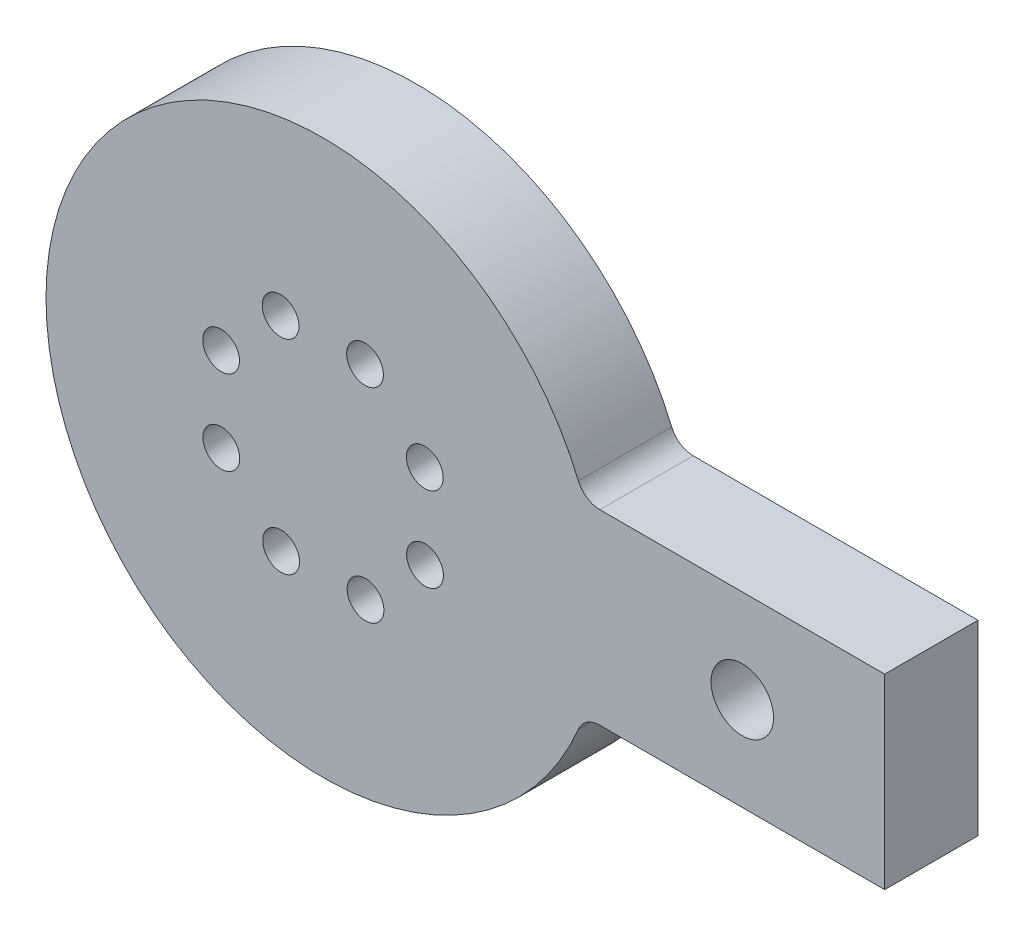
ISO-10303-21;
HEADER;
FILE_DESCRIPTION(('STEP AP214'),'2;1');
FILE_NAME('part.step','',(''),(''),'','','');
FILE_SCHEMA(('AUTOMOTIVE_DESIGN { 1 0 10303 214 1 1 1 1 }'));
ENDSEC;
DATA;
#1=APPLICATION_CONTEXT('core data for automotive mechanical design processes');
#2=APPLICATION_PROTOCOL_DEFINITION('international standard','automotive_design',2000,#1);
#3=PRODUCT_CONTEXT('',#1,'mechanical');
#4=PRODUCT('Part','Part','',(#3));
#5=PRODUCT_RELATED_PRODUCT_CATEGORY('part','',(#4));
#6=PRODUCT_DEFINITION_FORMATION('','',#4);
#7=PRODUCT_DEFINITION_CONTEXT('part definition',#1,'design');
#8=PRODUCT_DEFINITION('design','',#6,#7);
#9=PRODUCT_DEFINITION_SHAPE('','',#8);
#10=(LENGTH_UNIT() NAMED_UNIT(*) SI_UNIT(.MILLI.,.METRE.));
#11=(NAMED_UNIT(*) PLANE_ANGLE_UNIT() SI_UNIT($,.RADIAN.));
#12=(NAMED_UNIT(*) SI_UNIT($,.STERADIAN.) SOLID_ANGLE_UNIT());
#13=UNCERTAINTY_MEASURE_WITH_UNIT(LENGTH_MEASURE(1.E-05),#10,'distance_accuracy_value','');
#14=(GEOMETRIC_REPRESENTATION_CONTEXT(3) GLOBAL_UNCERTAINTY_ASSIGNED_CONTEXT((#13)) GLOBAL_UNIT_ASSIGNED_CONTEXT((#10,
#11,#12)) REPRESENTATION_CONTEXT('',''));
#15=CARTESIAN_POINT('',(0.,0.,0.));
#16=DIRECTION('',(0.,0.,1.));
#17=DIRECTION('',(1.,0.,0.));
#18=AXIS2_PLACEMENT_3D('',#15,#16,#17);
#19=CARTESIAN_POINT('',(0.,0.,12.7));
#20=DIRECTION('',(0.,0.,-1.));
#21=DIRECTION('',(-1.,0.,0.));
#22=AXIS2_PLACEMENT_3D('',#19,#20,#21);
#23=CYLINDRICAL_SURFACE('',#22,37.7);
#24=CARTESIAN_POINT('',(0.,0.,0.));
#25=DIRECTION('',(0.,0.,1.));
#26=DIRECTION('',(1.,0.,0.));
#27=AXIS2_PLACEMENT_3D('',#24,#25,#26);
#28=CIRCLE('',#27,37.7);
#29=CARTESIAN_POINT('',(34.7405365647792,14.6418960244648,0.));
#30=VERTEX_POINT('',#29);
#31=CARTESIAN_POINT('',(34.7405365647792,-14.6418960244648,0.));
#32=VERTEX_POINT('',#31);
#33=EDGE_CURVE('E144',#30,#32,#28,.T.);
#34=ORIENTED_EDGE('',*,*,#33,.T.);
#35=DIRECTION('',(0.,0.,-1.));
#36=VECTOR('',#35,1.);
#37=CARTESIAN_POINT('',(34.7405365647792,-14.6418960244648,12.7));
#38=LINE('',#37,#36);
#39=CARTESIAN_POINT('',(34.7405365647792,-14.6418960244648,12.7));
#40=VERTEX_POINT('',#39);
#41=EDGE_CURVE('E176',#32,#40,#38,.F.);
#42=ORIENTED_EDGE('',*,*,#41,.T.);
#43=CARTESIAN_POINT('',(0.,0.,12.7));
#44=DIRECTION('',(0.,0.,1.));
#45=DIRECTION('',(1.,0.,0.));
#46=AXIS2_PLACEMENT_3D('',#43,#44,#45);
#47=CIRCLE('',#46,37.7);
#48=CARTESIAN_POINT('',(34.7405365647792,14.6418960244648,12.7));
#49=VERTEX_POINT('',#48);
#50=EDGE_CURVE('E99',#49,#40,#47,.T.);
#51=ORIENTED_EDGE('',*,*,#50,.F.);
#52=DIRECTION('',(0.,0.,-1.));
#53=VECTOR('',#52,1.);
#54=CARTESIAN_POINT('',(34.7405365647792,14.6418960244648,12.7));
#55=LINE('',#54,#53);
#56=EDGE_CURVE('E173',#49,#30,#55,.T.);
#57=ORIENTED_EDGE('',*,*,#56,.T.);
#58=EDGE_LOOP('',(#34,#42,#51,#57));
#59=FACE_BOUND('',#58,.T.);
#60=ADVANCED_FACE('F35',(#59),#23,.T.);
#61=CARTESIAN_POINT('',(0.,-12.7,12.7));
#62=DIRECTION('',(0.,1.,0.));
#63=DIRECTION('',(0.,0.,1.));
#64=AXIS2_PLACEMENT_3D('',#61,#62,#63);
#65=PLANE('',#64);
#66=DIRECTION('',(1.,0.,0.));
#67=VECTOR('',#66,1.);
#68=CARTESIAN_POINT('',(0.,-12.7,12.7));
#69=LINE('',#68,#67);
#70=CARTESIAN_POINT('',(37.6662979332984,-12.7,12.7));
#71=VERTEX_POINT('',#70);
#72=CARTESIAN_POINT('',(76.4173000154748,-12.7,12.7));
#73=VERTEX_POINT('',#72);
#74=EDGE_CURVE('E86',#71,#73,#69,.T.);
#75=ORIENTED_EDGE('',*,*,#74,.F.);
#76=DIRECTION('',(0.,0.,1.));
#77=VECTOR('',#76,1.);
#78=CARTESIAN_POINT('',(37.6662979332984,-12.7,0.));
#79=LINE('',#78,#77);
#80=CARTESIAN_POINT('',(37.6662979332984,-12.7,0.));
#81=VERTEX_POINT('',#80);
#82=EDGE_CURVE('E109',#71,#81,#79,.F.);
#83=ORIENTED_EDGE('',*,*,#82,.T.);
#84=DIRECTION('',(1.,0.,0.));
#85=VECTOR('',#84,1.);
#86=CARTESIAN_POINT('',(0.,-12.7,0.));
#87=LINE('',#86,#85);
#88=CARTESIAN_POINT('',(76.4173000154748,-12.7,0.));
#89=VERTEX_POINT('',#88);
#90=EDGE_CURVE('E105',#81,#89,#87,.T.);
#91=ORIENTED_EDGE('',*,*,#90,.T.);
#92=DIRECTION('',(0.,0.,-1.));
#93=VECTOR('',#92,1.);
#94=CARTESIAN_POINT('',(76.4173000154748,-12.7,12.7));
#95=LINE('',#94,#93);
#96=EDGE_CURVE('E102',#73,#89,#95,.T.);
#97=ORIENTED_EDGE('',*,*,#96,.F.);
#98=EDGE_LOOP('',(#75,#83,#91,#97));
#99=FACE_BOUND('',#98,.T.);
#100=ADVANCED_FACE('F103',(#99),#65,.F.);
#101=CARTESIAN_POINT('',(76.4173000154748,0.,12.7));
#102=DIRECTION('',(-1.,0.,0.));
#103=DIRECTION('',(0.,0.,1.));
#104=AXIS2_PLACEMENT_3D('',#101,#102,#103);
#105=PLANE('',#104);
#106=DIRECTION('',(0.,1.,0.));
#107=VECTOR('',#106,1.);
#108=CARTESIAN_POINT('',(76.4173000154748,0.,0.));
#109=LINE('',#108,#107);
#110=CARTESIAN_POINT('',(76.4173000154748,12.7,0.));
#111=VERTEX_POINT('',#110);
#112=EDGE_CURVE('E148',#89,#111,#109,.T.);
#113=ORIENTED_EDGE('',*,*,#112,.T.);
#114=DIRECTION('',(0.,0.,-1.));
#115=VECTOR('',#114,1.);
#116=CARTESIAN_POINT('',(76.4173000154748,12.7,12.7));
#117=LINE('',#116,#115);
#118=CARTESIAN_POINT('',(76.4173000154748,12.7,12.7));
#119=VERTEX_POINT('',#118);
#120=EDGE_CURVE('E110',#119,#111,#117,.T.);
#121=ORIENTED_EDGE('',*,*,#120,.F.);
#122=DIRECTION('',(0.,1.,0.));
#123=VECTOR('',#122,1.);
#124=CARTESIAN_POINT('',(76.4173000154748,0.,12.7));
#125=LINE('',#124,#123);
#126=EDGE_CURVE('E91',#73,#119,#125,.T.);
#127=ORIENTED_EDGE('',*,*,#126,.F.);
#128=ORIENTED_EDGE('',*,*,#96,.T.);
#129=EDGE_LOOP('',(#113,#121,#127,#128));
#130=FACE_BOUND('',#129,.T.);
#131=ADVANCED_FACE('F112',(#130),#105,.F.);
#132=CARTESIAN_POINT('',(13.8436983699948,5.77512038321301,12.7));
#133=DIRECTION('',(0.,0.,-1.));
#134=DIRECTION('',(-1.,0.,0.));
#135=AXIS2_PLACEMENT_3D('',#132,#133,#134);
#136=CYLINDRICAL_SURFACE('',#135,2.49999999999999);
#137=CARTESIAN_POINT('',(13.8436983699948,5.77512038321301,12.7));
#138=DIRECTION('',(0.,0.,1.));
#139=DIRECTION('',(1.,0.,0.));
#140=AXIS2_PLACEMENT_3D('',#137,#138,#139);
#141=CIRCLE('',#140,2.49999999999999);
#142=CARTESIAN_POINT('',(16.3436983699948,5.77512038321301,12.7));
#143=VERTEX_POINT('',#142);
#144=EDGE_CURVE('E131',#143,#143,#141,.T.);
#145=ORIENTED_EDGE('',*,*,#144,.T.);
#146=EDGE_LOOP('',(#145));
#147=FACE_BOUND('',#146,.T.);
#148=CARTESIAN_POINT('',(13.8436983699948,5.77512038321301,0.));
#149=DIRECTION('',(0.,0.,1.));
#150=DIRECTION('',(1.,0.,0.));
#151=AXIS2_PLACEMENT_3D('',#148,#149,#150);
#152=CIRCLE('',#151,2.49999999999999);
#153=CARTESIAN_POINT('',(16.3436983699948,5.77512038321301,0.));
#154=VERTEX_POINT('',#153);
#155=EDGE_CURVE('E164',#154,#154,#152,.T.);
#156=ORIENTED_EDGE('',*,*,#155,.F.);
#157=EDGE_LOOP('',(#156));
#158=FACE_BOUND('',#157,.T.);
#159=ADVANCED_FACE('F247',(#147,#158),#136,.F.);
#160=CARTESIAN_POINT('',(-13.8725997792633,5.70534620898534,12.7));
#161=DIRECTION('',(0.,0.,-1.));
#162=DIRECTION('',(-1.,0.,0.));
#163=AXIS2_PLACEMENT_3D('',#160,#161,#162);
#164=CYLINDRICAL_SURFACE('',#163,2.5);
#165=CARTESIAN_POINT('',(-13.8725997792633,5.70534620898534,12.7));
#166=DIRECTION('',(0.,0.,1.));
#167=DIRECTION('',(1.,0.,0.));
#168=AXIS2_PLACEMENT_3D('',#165,#166,#167);
#169=CIRCLE('',#168,2.5);
#170=CARTESIAN_POINT('',(-11.3725997792633,5.70534620898534,12.7));
#171=VERTEX_POINT('',#170);
#172=EDGE_CURVE('E128',#171,#171,#169,.T.);
#173=ORIENTED_EDGE('',*,*,#172,.T.);
#174=EDGE_LOOP('',(#173));
#175=FACE_BOUND('',#174,.T.);
#176=CARTESIAN_POINT('',(-13.8725997792633,5.70534620898534,0.));
#177=DIRECTION('',(0.,0.,1.));
#178=DIRECTION('',(1.,0.,0.));
#179=AXIS2_PLACEMENT_3D('',#176,#177,#178);
#180=CIRCLE('',#179,2.5);
#181=CARTESIAN_POINT('',(-11.3725997792633,5.70534620898534,0.));
#182=VERTEX_POINT('',#181);
#183=EDGE_CURVE('E161',#182,#182,#180,.T.);
#184=ORIENTED_EDGE('',*,*,#183,.F.);
#185=EDGE_LOOP('',(#184));
#186=FACE_BOUND('',#185,.T.);
#187=ADVANCED_FACE('F251',(#175,#186),#164,.F.);
#188=CARTESIAN_POINT('',(-13.8436983699948,-5.7751203832136,12.7));
#189=DIRECTION('',(0.,0.,-1.));
#190=DIRECTION('',(-1.,0.,0.));
#191=AXIS2_PLACEMENT_3D('',#188,#189,#190);
#192=CYLINDRICAL_SURFACE('',#191,2.5);
#193=CARTESIAN_POINT('',(-13.8436983699948,-5.7751203832136,12.7));
#194=DIRECTION('',(0.,0.,1.));
#195=DIRECTION('',(1.,0.,0.));
#196=AXIS2_PLACEMENT_3D('',#193,#194,#195);
#197=CIRCLE('',#196,2.5);
#198=CARTESIAN_POINT('',(-11.3436983699948,-5.7751203832136,12.7));
#199=VERTEX_POINT('',#198);
#200=EDGE_CURVE('E125',#199,#199,#197,.T.);
#201=ORIENTED_EDGE('',*,*,#200,.T.);
#202=EDGE_LOOP('',(#201));
#203=FACE_BOUND('',#202,.T.);
#204=CARTESIAN_POINT('',(-13.8436983699948,-5.7751203832136,0.));
#205=DIRECTION('',(0.,0.,1.));
#206=DIRECTION('',(1.,0.,0.));
#207=AXIS2_PLACEMENT_3D('',#204,#205,#206);
#208=CIRCLE('',#207,2.5);
#209=CARTESIAN_POINT('',(-11.3436983699948,-5.7751203832136,0.));
#210=VERTEX_POINT('',#209);
#211=EDGE_CURVE('E158',#210,#210,#208,.T.);
#212=ORIENTED_EDGE('',*,*,#211,.F.);
#213=EDGE_LOOP('',(#212));
#214=FACE_BOUND('',#213,.T.);
#215=ADVANCED_FACE('F257',(#203,#214),#192,.F.);
#216=CARTESIAN_POINT('',(-5.70534620898581,-13.8725997792631,12.7));
#217=DIRECTION('',(0.,0.,-1.));
#218=DIRECTION('',(-1.,0.,0.));
#219=AXIS2_PLACEMENT_3D('',#216,#217,#218);
#220=CYLINDRICAL_SURFACE('',#219,2.5);
#221=CARTESIAN_POINT('',(-5.70534620898581,-13.8725997792631,12.7));
#222=DIRECTION('',(0.,0.,1.));
#223=DIRECTION('',(1.,0.,0.));
#224=AXIS2_PLACEMENT_3D('',#221,#222,#223);
#225=CIRCLE('',#224,2.5);
#226=CARTESIAN_POINT('',(-3.20534620898581,-13.8725997792631,12.7));
#227=VERTEX_POINT('',#226);
#228=EDGE_CURVE('E122',#227,#227,#225,.T.);
#229=ORIENTED_EDGE('',*,*,#228,.T.);
#230=EDGE_LOOP('',(#229));
#231=FACE_BOUND('',#230,.T.);
#232=CARTESIAN_POINT('',(-5.70534620898581,-13.8725997792631,0.));
#233=DIRECTION('',(0.,0.,1.));
#234=DIRECTION('',(1.,0.,0.));
#235=AXIS2_PLACEMENT_3D('',#232,#233,#234);
#236=CIRCLE('',#235,2.5);
#237=CARTESIAN_POINT('',(-3.20534620898581,-13.8725997792631,0.));
#238=VERTEX_POINT('',#237);
#239=EDGE_CURVE('E155',#238,#238,#236,.T.);
#240=ORIENTED_EDGE('',*,*,#239,.F.);
#241=EDGE_LOOP('',(#240));
#242=FACE_BOUND('',#241,.T.);
#243=ADVANCED_FACE('F242',(#231,#242),#220,.F.);
#244=CARTESIAN_POINT('',(-5.77512038321348,13.8436983699945,12.7));
#245=DIRECTION('',(0.,0.,-1.));
#246=DIRECTION('',(-1.,0.,0.));
#247=AXIS2_PLACEMENT_3D('',#244,#245,#246);
#248=CYLINDRICAL_SURFACE('',#247,2.5);
#249=CARTESIAN_POINT('',(-5.77512038321348,13.8436983699945,12.7));
#250=DIRECTION('',(0.,0.,1.));
#251=DIRECTION('',(1.,0.,0.));
#252=AXIS2_PLACEMENT_3D('',#249,#250,#251);
#253=CIRCLE('',#252,2.5);
#254=CARTESIAN_POINT('',(-3.27512038321349,13.8436983699945,12.7));
#255=VERTEX_POINT('',#254);
#256=EDGE_CURVE('E116',#255,#255,#253,.T.);
#257=ORIENTED_EDGE('',*,*,#256,.T.);
#258=EDGE_LOOP('',(#257));
#259=FACE_BOUND('',#258,.T.);
#260=CARTESIAN_POINT('',(-5.77512038321348,13.8436983699945,0.));
#261=DIRECTION('',(0.,0.,1.));
#262=DIRECTION('',(1.,0.,0.));
#263=AXIS2_PLACEMENT_3D('',#260,#261,#262);
#264=CIRCLE('',#263,2.5);
#265=CARTESIAN_POINT('',(-3.27512038321349,13.8436983699945,0.));
#266=VERTEX_POINT('',#265);
#267=EDGE_CURVE('E152',#266,#266,#264,.T.);
#268=ORIENTED_EDGE('',*,*,#267,.F.);
#269=EDGE_LOOP('',(#268));
#270=FACE_BOUND('',#269,.T.);
#271=ADVANCED_FACE('F237',(#259,#270),#248,.F.);
#272=CARTESIAN_POINT('',(0.,12.7,12.7));
#273=DIRECTION('',(0.,1.,0.));
#274=DIRECTION('',(0.,0.,1.));
#275=AXIS2_PLACEMENT_3D('',#272,#273,#274);
#276=PLANE('',#275);
#277=DIRECTION('',(1.,0.,0.));
#278=VECTOR('',#277,1.);
#279=CARTESIAN_POINT('',(0.,12.7,0.));
#280=LINE('',#279,#278);
#281=CARTESIAN_POINT('',(37.6662979332984,12.7,0.));
#282=VERTEX_POINT('',#281);
#283=EDGE_CURVE('E150',#282,#111,#280,.T.);
#284=ORIENTED_EDGE('',*,*,#283,.F.);
#285=DIRECTION('',(0.,0.,-1.));
#286=VECTOR('',#285,1.);
#287=CARTESIAN_POINT('',(37.6662979332984,12.7,12.7));
#288=LINE('',#287,#286);
#289=CARTESIAN_POINT('',(37.6662979332984,12.7,12.7));
#290=VERTEX_POINT('',#289);
#291=EDGE_CURVE('E50',#282,#290,#288,.F.);
#292=ORIENTED_EDGE('',*,*,#291,.T.);
#293=DIRECTION('',(1.,0.,0.));
#294=VECTOR('',#293,1.);
#295=CARTESIAN_POINT('',(0.,12.7,12.7));
#296=LINE('',#295,#294);
#297=EDGE_CURVE('E114',#290,#119,#296,.T.);
#298=ORIENTED_EDGE('',*,*,#297,.T.);
#299=ORIENTED_EDGE('',*,*,#120,.T.);
#300=EDGE_LOOP('',(#284,#292,#298,#299));
#301=FACE_BOUND('',#300,.T.);
#302=ADVANCED_FACE('F210',(#301),#276,.T.);
#303=CARTESIAN_POINT('',(5.70534620898545,13.872599779263,12.7));
#304=DIRECTION('',(0.,0.,-1.));
#305=DIRECTION('',(-1.,0.,0.));
#306=AXIS2_PLACEMENT_3D('',#303,#304,#305);
#307=CYLINDRICAL_SURFACE('',#306,2.5);
#308=CARTESIAN_POINT('',(5.70534620898545,13.872599779263,12.7));
#309=DIRECTION('',(0.,0.,1.));
#310=DIRECTION('',(1.,0.,0.));
#311=AXIS2_PLACEMENT_3D('',#308,#309,#310);
#312=CIRCLE('',#311,2.5);
#313=CARTESIAN_POINT('',(8.20534620898545,13.872599779263,12.7));
#314=VERTEX_POINT('',#313);
#315=EDGE_CURVE('E229',#314,#314,#312,.T.);
#316=ORIENTED_EDGE('',*,*,#315,.T.);
#317=EDGE_LOOP('',(#316));
#318=FACE_BOUND('',#317,.T.);
#319=CARTESIAN_POINT('',(5.70534620898545,13.872599779263,0.));
#320=DIRECTION('',(0.,0.,1.));
#321=DIRECTION('',(1.,0.,0.));
#322=AXIS2_PLACEMENT_3D('',#319,#320,#321);
#323=CIRCLE('',#322,2.5);
#324=CARTESIAN_POINT('',(8.20534620898545,13.872599779263,0.));
#325=VERTEX_POINT('',#324);
#326=EDGE_CURVE('E140',#325,#325,#323,.T.);
#327=ORIENTED_EDGE('',*,*,#326,.F.);
#328=EDGE_LOOP('',(#327));
#329=FACE_BOUND('',#328,.T.);
#330=ADVANCED_FACE('F207',(#318,#329),#307,.F.);
#331=CARTESIAN_POINT('',(5.77512038321315,-13.8436983699948,12.7));
#332=DIRECTION('',(0.,0.,-1.));
#333=DIRECTION('',(-1.,0.,0.));
#334=AXIS2_PLACEMENT_3D('',#331,#332,#333);
#335=CYLINDRICAL_SURFACE('',#334,2.5);
#336=CARTESIAN_POINT('',(5.77512038321315,-13.8436983699948,12.7));
#337=DIRECTION('',(0.,0.,1.));
#338=DIRECTION('',(1.,0.,0.));
#339=AXIS2_PLACEMENT_3D('',#336,#337,#338);
#340=CIRCLE('',#339,2.5);
#341=CARTESIAN_POINT('',(8.27512038321315,-13.8436983699948,12.7));
#342=VERTEX_POINT('',#341);
#343=EDGE_CURVE('E170',#342,#342,#340,.T.);
#344=ORIENTED_EDGE('',*,*,#343,.T.);
#345=EDGE_LOOP('',(#344));
#346=FACE_BOUND('',#345,.T.);
#347=CARTESIAN_POINT('',(5.77512038321315,-13.8436983699948,0.));
#348=DIRECTION('',(0.,0.,1.));
#349=DIRECTION('',(1.,0.,0.));
#350=AXIS2_PLACEMENT_3D('',#347,#348,#349);
#351=CIRCLE('',#350,2.5);
#352=CARTESIAN_POINT('',(8.27512038321315,-13.8436983699948,0.));
#353=VERTEX_POINT('',#352);
#354=EDGE_CURVE('E137',#353,#353,#351,.T.);
#355=ORIENTED_EDGE('',*,*,#354,.F.);
#356=EDGE_LOOP('',(#355));
#357=FACE_BOUND('',#356,.T.);
#358=ADVANCED_FACE('F209',(#346,#357),#335,.F.);
#359=CARTESIAN_POINT('',(13.8725997792631,-5.70534620898576,12.7));
#360=DIRECTION('',(0.,0.,-1.));
#361=DIRECTION('',(-1.,0.,0.));
#362=AXIS2_PLACEMENT_3D('',#359,#360,#361);
#363=CYLINDRICAL_SURFACE('',#362,2.5);
#364=CARTESIAN_POINT('',(13.8725997792631,-5.70534620898576,12.7));
#365=DIRECTION('',(0.,0.,1.));
#366=DIRECTION('',(1.,0.,0.));
#367=AXIS2_PLACEMENT_3D('',#364,#365,#366);
#368=CIRCLE('',#367,2.5);
#369=CARTESIAN_POINT('',(16.3725997792631,-5.70534620898576,12.7));
#370=VERTEX_POINT('',#369);
#371=EDGE_CURVE('E134',#370,#370,#368,.T.);
#372=ORIENTED_EDGE('',*,*,#371,.T.);
#373=EDGE_LOOP('',(#372));
#374=FACE_BOUND('',#373,.T.);
#375=CARTESIAN_POINT('',(13.8725997792631,-5.70534620898576,0.));
#376=DIRECTION('',(0.,0.,1.));
#377=DIRECTION('',(1.,0.,0.));
#378=AXIS2_PLACEMENT_3D('',#375,#376,#377);
#379=CIRCLE('',#378,2.5);
#380=CARTESIAN_POINT('',(16.3725997792631,-5.70534620898576,0.));
#381=VERTEX_POINT('',#380);
#382=EDGE_CURVE('E167',#381,#381,#379,.T.);
#383=ORIENTED_EDGE('',*,*,#382,.F.);
#384=EDGE_LOOP('',(#383));
#385=FACE_BOUND('',#384,.T.);
#386=ADVANCED_FACE('F213',(#374,#385),#363,.F.);
#387=CARTESIAN_POINT('',(0.,0.,12.7));
#388=DIRECTION('',(0.,0.,1.));
#389=DIRECTION('',(1.,0.,0.));
#390=AXIS2_PLACEMENT_3D('',#387,#388,#389);
#391=PLANE('',#390);
#392=CARTESIAN_POINT('',(57.0417989743866,0.,12.7));
#393=DIRECTION('',(0.,0.,1.));
#394=DIRECTION('',(1.,0.,0.));
#395=AXIS2_PLACEMENT_3D('',#392,#393,#394);
#396=CIRCLE('',#395,4.24999999999999);
#397=CARTESIAN_POINT('',(61.2917989743866,0.,12.7));
#398=VERTEX_POINT('',#397);
#399=EDGE_CURVE('E305',#398,#398,#396,.T.);
#400=ORIENTED_EDGE('',*,*,#399,.F.);
#401=EDGE_LOOP('',(#400));
#402=FACE_BOUND('',#401,.T.);
#403=ORIENTED_EDGE('',*,*,#343,.F.);
#404=EDGE_LOOP('',(#403));
#405=FACE_BOUND('',#404,.T.);
#406=ORIENTED_EDGE('',*,*,#315,.F.);
#407=EDGE_LOOP('',(#406));
#408=FACE_BOUND('',#407,.T.);
#409=ORIENTED_EDGE('',*,*,#297,.F.);
#410=CARTESIAN_POINT('',(37.6662979332984,15.875,12.7));
#411=DIRECTION('',(0.,0.,1.));
#412=DIRECTION('',(1.,0.,0.));
#413=AXIS2_PLACEMENT_3D('',#410,#411,#412);
#414=CIRCLE('',#413,3.175);
#415=EDGE_CURVE('E11',#290,#49,#414,.F.);
#416=ORIENTED_EDGE('',*,*,#415,.T.);
#417=ORIENTED_EDGE('',*,*,#50,.T.);
#418=CARTESIAN_POINT('',(37.6662979332984,-15.875,12.7));
#419=DIRECTION('',(0.,0.,1.));
#420=DIRECTION('',(1.,0.,0.));
#421=AXIS2_PLACEMENT_3D('',#418,#419,#420);
#422=CIRCLE('',#421,3.175);
#423=EDGE_CURVE('E95',#40,#71,#422,.F.);
#424=ORIENTED_EDGE('',*,*,#423,.T.);
#425=ORIENTED_EDGE('',*,*,#74,.T.);
#426=ORIENTED_EDGE('',*,*,#126,.T.);
#427=EDGE_LOOP('',(#409,#416,#417,#424,#425,#426));
#428=FACE_BOUND('',#427,.T.);
#429=ORIENTED_EDGE('',*,*,#256,.F.);
#430=EDGE_LOOP('',(#429));
#431=FACE_BOUND('',#430,.T.);
#432=ORIENTED_EDGE('',*,*,#228,.F.);
#433=EDGE_LOOP('',(#432));
#434=FACE_BOUND('',#433,.T.);
#435=ORIENTED_EDGE('',*,*,#200,.F.);
#436=EDGE_LOOP('',(#435));
#437=FACE_BOUND('',#436,.T.);
#438=ORIENTED_EDGE('',*,*,#172,.F.);
#439=EDGE_LOOP('',(#438));
#440=FACE_BOUND('',#439,.T.);
#441=ORIENTED_EDGE('',*,*,#144,.F.);
#442=EDGE_LOOP('',(#441));
#443=FACE_BOUND('',#442,.T.);
#444=ORIENTED_EDGE('',*,*,#371,.F.);
#445=EDGE_LOOP('',(#444));
#446=FACE_BOUND('',#445,.T.);
#447=ADVANCED_FACE('F88',(#402,#405,#408,#428,#431,#434,#437,#440,#443,#446),#391,.T.);
#448=CARTESIAN_POINT('',(0.,0.,0.));
#449=DIRECTION('',(0.,0.,1.));
#450=DIRECTION('',(1.,0.,0.));
#451=AXIS2_PLACEMENT_3D('',#448,#449,#450);
#452=PLANE('',#451);
#453=CARTESIAN_POINT('',(57.0417989743866,0.,0.));
#454=DIRECTION('',(0.,0.,1.));
#455=DIRECTION('',(1.,0.,0.));
#456=AXIS2_PLACEMENT_3D('',#453,#454,#455);
#457=CIRCLE('',#456,4.24999999999999);
#458=CARTESIAN_POINT('',(61.2917989743866,0.,0.));
#459=VERTEX_POINT('',#458);
#460=EDGE_CURVE('E141',#459,#459,#457,.T.);
#461=ORIENTED_EDGE('',*,*,#460,.T.);
#462=EDGE_LOOP('',(#461));
#463=FACE_BOUND('',#462,.T.);
#464=ORIENTED_EDGE('',*,*,#354,.T.);
#465=EDGE_LOOP('',(#464));
#466=FACE_BOUND('',#465,.T.);
#467=ORIENTED_EDGE('',*,*,#326,.T.);
#468=EDGE_LOOP('',(#467));
#469=FACE_BOUND('',#468,.T.);
#470=ORIENTED_EDGE('',*,*,#33,.F.);
#471=CARTESIAN_POINT('',(37.6662979332984,15.875,0.));
#472=DIRECTION('',(0.,0.,1.));
#473=DIRECTION('',(1.,0.,0.));
#474=AXIS2_PLACEMENT_3D('',#471,#472,#473);
#475=CIRCLE('',#474,3.175);
#476=EDGE_CURVE('E43',#30,#282,#475,.T.);
#477=ORIENTED_EDGE('',*,*,#476,.T.);
#478=ORIENTED_EDGE('',*,*,#283,.T.);
#479=ORIENTED_EDGE('',*,*,#112,.F.);
#480=ORIENTED_EDGE('',*,*,#90,.F.);
#481=CARTESIAN_POINT('',(37.6662979332984,-15.875,0.));
#482=DIRECTION('',(0.,0.,1.));
#483=DIRECTION('',(1.,0.,0.));
#484=AXIS2_PLACEMENT_3D('',#481,#482,#483);
#485=CIRCLE('',#484,3.175);
#486=EDGE_CURVE('E179',#81,#32,#485,.T.);
#487=ORIENTED_EDGE('',*,*,#486,.T.);
#488=EDGE_LOOP('',(#470,#477,#478,#479,#480,#487));
#489=FACE_BOUND('',#488,.T.);
#490=ORIENTED_EDGE('',*,*,#267,.T.);
#491=EDGE_LOOP('',(#490));
#492=FACE_BOUND('',#491,.T.);
#493=ORIENTED_EDGE('',*,*,#239,.T.);
#494=EDGE_LOOP('',(#493));
#495=FACE_BOUND('',#494,.T.);
#496=ORIENTED_EDGE('',*,*,#211,.T.);
#497=EDGE_LOOP('',(#496));
#498=FACE_BOUND('',#497,.T.);
#499=ORIENTED_EDGE('',*,*,#183,.T.);
#500=EDGE_LOOP('',(#499));
#501=FACE_BOUND('',#500,.T.);
#502=ORIENTED_EDGE('',*,*,#155,.T.);
#503=EDGE_LOOP('',(#502));
#504=FACE_BOUND('',#503,.T.);
#505=ORIENTED_EDGE('',*,*,#382,.T.);
#506=EDGE_LOOP('',(#505));
#507=FACE_BOUND('',#506,.T.);
#508=ADVANCED_FACE('F181',(#463,#466,#469,#489,#492,#495,#498,#501,#504,#507),#452,.F.);
#509=CARTESIAN_POINT('',(37.6662979332984,-15.875,12.7));
#510=DIRECTION('',(0.,0.,-1.));
#511=DIRECTION('',(-1.,0.,0.));
#512=AXIS2_PLACEMENT_3D('',#509,#510,#511);
#513=CYLINDRICAL_SURFACE('',#512,3.175);
#514=ORIENTED_EDGE('',*,*,#423,.F.);
#515=ORIENTED_EDGE('',*,*,#41,.F.);
#516=ORIENTED_EDGE('',*,*,#486,.F.);
#517=ORIENTED_EDGE('',*,*,#82,.F.);
#518=EDGE_LOOP('',(#514,#515,#516,#517));
#519=FACE_BOUND('',#518,.T.);
#520=ADVANCED_FACE('F188',(#519),#513,.F.);
#521=CARTESIAN_POINT('',(37.6662979332984,15.875,12.7));
#522=DIRECTION('',(0.,0.,-1.));
#523=DIRECTION('',(-1.,0.,0.));
#524=AXIS2_PLACEMENT_3D('',#521,#522,#523);
#525=CYLINDRICAL_SURFACE('',#524,3.175);
#526=ORIENTED_EDGE('',*,*,#415,.F.);
#527=ORIENTED_EDGE('',*,*,#291,.F.);
#528=ORIENTED_EDGE('',*,*,#476,.F.);
#529=ORIENTED_EDGE('',*,*,#56,.F.);
#530=EDGE_LOOP('',(#526,#527,#528,#529));
#531=FACE_BOUND('',#530,.T.);
#532=ADVANCED_FACE('F37',(#531),#525,.F.);
#533=CARTESIAN_POINT('',(57.0417989743866,0.,12.7));
#534=DIRECTION('',(0.,0.,1.));
#535=DIRECTION('',(1.,0.,0.));
#536=AXIS2_PLACEMENT_3D('',#533,#534,#535);
#537=CYLINDRICAL_SURFACE('',#536,4.24999999999999);
#538=ORIENTED_EDGE('',*,*,#399,.T.);
#539=EDGE_LOOP('',(#538));
#540=FACE_BOUND('',#539,.T.);
#541=ORIENTED_EDGE('',*,*,#460,.F.);
#542=EDGE_LOOP('',(#541));
#543=FACE_BOUND('',#542,.T.);
#544=ADVANCED_FACE('F194',(#540,#543),#537,.F.);
#545=CLOSED_SHELL('',(#60,#100,#131,#159,#187,#215,#243,#271,#302,#330,#358,#386,#447,#508,#520,
#532,#544));
#546=MANIFOLD_SOLID_BREP('B2',#545);
#547=ADVANCED_BREP_SHAPE_REPRESENTATION('',(#18,#546),#14);
#548=SHAPE_DEFINITION_REPRESENTATION(#9,#547);
ENDSEC;
END-ISO-10303-21;
